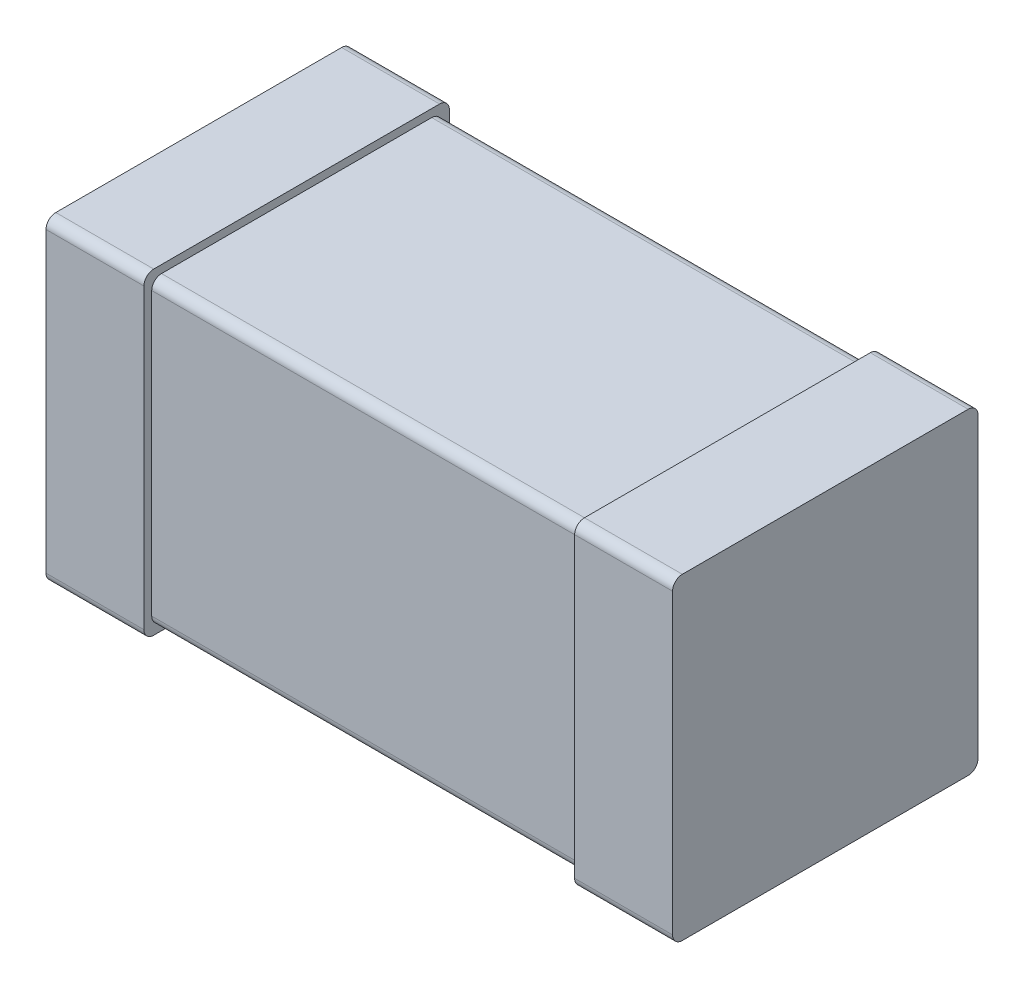
ISO-10303-21;
HEADER;
FILE_DESCRIPTION(('STEP AP214'),'2;1');
FILE_NAME('part.step','',(''),(''),'','','');
FILE_SCHEMA(('AUTOMOTIVE_DESIGN { 1 0 10303 214 1 1 1 1 }'));
ENDSEC;
DATA;
#1=APPLICATION_CONTEXT('core data for automotive mechanical design processes');
#2=APPLICATION_PROTOCOL_DEFINITION('international standard','automotive_design',2000,#1);
#3=PRODUCT_CONTEXT('',#1,'mechanical');
#4=PRODUCT('Part','Part','',(#3));
#5=PRODUCT_RELATED_PRODUCT_CATEGORY('part','',(#4));
#6=PRODUCT_DEFINITION_FORMATION('','',#4);
#7=PRODUCT_DEFINITION_CONTEXT('part definition',#1,'design');
#8=PRODUCT_DEFINITION('design','',#6,#7);
#9=PRODUCT_DEFINITION_SHAPE('','',#8);
#10=(LENGTH_UNIT() NAMED_UNIT(*) SI_UNIT(.MILLI.,.METRE.));
#11=(NAMED_UNIT(*) PLANE_ANGLE_UNIT() SI_UNIT($,.RADIAN.));
#12=(NAMED_UNIT(*) SI_UNIT($,.STERADIAN.) SOLID_ANGLE_UNIT());
#13=UNCERTAINTY_MEASURE_WITH_UNIT(LENGTH_MEASURE(1.E-05),#10,'distance_accuracy_value','');
#14=(GEOMETRIC_REPRESENTATION_CONTEXT(3) GLOBAL_UNCERTAINTY_ASSIGNED_CONTEXT((#13)) GLOBAL_UNIT_ASSIGNED_CONTEXT((#10,
#11,#12)) REPRESENTATION_CONTEXT('',''));
#15=CARTESIAN_POINT('',(0.,0.,0.));
#16=DIRECTION('',(0.,0.,1.));
#17=DIRECTION('',(1.,0.,0.));
#18=AXIS2_PLACEMENT_3D('',#15,#16,#17);
#19=CARTESIAN_POINT('',(-0.8,-0.405,0.));
#20=DIRECTION('',(1.,0.,0.));
#21=DIRECTION('',(0.,0.,-1.));
#22=AXIS2_PLACEMENT_3D('',#19,#20,#21);
#23=PLANE('',#22);
#24=DIRECTION('',(0.,1.,0.));
#25=VECTOR('',#24,1.);
#26=CARTESIAN_POINT('',(-0.8,-0.405,0.78));
#27=LINE('',#26,#25);
#28=CARTESIAN_POINT('',(-0.8,0.38,0.78));
#29=VERTEX_POINT('',#28);
#30=CARTESIAN_POINT('',(-0.8,-0.38,0.78));
#31=VERTEX_POINT('',#30);
#32=EDGE_CURVE('E300',#29,#31,#27,.F.);
#33=ORIENTED_EDGE('',*,*,#32,.F.);
#34=CARTESIAN_POINT('',(-0.8,0.38,0.755));
#35=DIRECTION('',(1.,0.,0.));
#36=DIRECTION('',(0.,0.,-1.));
#37=AXIS2_PLACEMENT_3D('',#34,#35,#36);
#38=CIRCLE('',#37,0.025);
#39=CARTESIAN_POINT('',(-0.8,0.405,0.755));
#40=VERTEX_POINT('',#39);
#41=EDGE_CURVE('E279',#40,#29,#38,.T.);
#42=ORIENTED_EDGE('',*,*,#41,.F.);
#43=DIRECTION('',(0.,0.,1.));
#44=VECTOR('',#43,1.);
#45=CARTESIAN_POINT('',(-0.8,0.405,0.));
#46=LINE('',#45,#44);
#47=CARTESIAN_POINT('',(-0.8,0.405,0.025));
#48=VERTEX_POINT('',#47);
#49=EDGE_CURVE('E201',#48,#40,#46,.T.);
#50=ORIENTED_EDGE('',*,*,#49,.F.);
#51=CARTESIAN_POINT('',(-0.8,0.38,0.025));
#52=DIRECTION('',(1.,0.,0.));
#53=DIRECTION('',(0.,0.,-1.));
#54=AXIS2_PLACEMENT_3D('',#51,#52,#53);
#55=CIRCLE('',#54,0.025);
#56=CARTESIAN_POINT('',(-0.8,0.38,0.));
#57=VERTEX_POINT('',#56);
#58=EDGE_CURVE('E196',#57,#48,#55,.T.);
#59=ORIENTED_EDGE('',*,*,#58,.F.);
#60=DIRECTION('',(0.,1.,0.));
#61=VECTOR('',#60,1.);
#62=CARTESIAN_POINT('',(-0.8,-0.405,0.));
#63=LINE('',#62,#61);
#64=CARTESIAN_POINT('',(-0.8,-0.38,0.));
#65=VERTEX_POINT('',#64);
#66=EDGE_CURVE('E188',#57,#65,#63,.F.);
#67=ORIENTED_EDGE('',*,*,#66,.T.);
#68=CARTESIAN_POINT('',(-0.8,-0.38,0.025));
#69=DIRECTION('',(1.,0.,0.));
#70=DIRECTION('',(0.,0.,-1.));
#71=AXIS2_PLACEMENT_3D('',#68,#69,#70);
#72=CIRCLE('',#71,0.025);
#73=CARTESIAN_POINT('',(-0.8,-0.405,0.025));
#74=VERTEX_POINT('',#73);
#75=EDGE_CURVE('E20',#74,#65,#72,.T.);
#76=ORIENTED_EDGE('',*,*,#75,.F.);
#77=DIRECTION('',(0.,0.,1.));
#78=VECTOR('',#77,1.);
#79=CARTESIAN_POINT('',(-0.8,-0.405,0.));
#80=LINE('',#79,#78);
#81=CARTESIAN_POINT('',(-0.8,-0.405,0.755));
#82=VERTEX_POINT('',#81);
#83=EDGE_CURVE('E171',#74,#82,#80,.T.);
#84=ORIENTED_EDGE('',*,*,#83,.T.);
#85=CARTESIAN_POINT('',(-0.8,-0.38,0.755));
#86=DIRECTION('',(1.,0.,0.));
#87=DIRECTION('',(0.,0.,-1.));
#88=AXIS2_PLACEMENT_3D('',#85,#86,#87);
#89=CIRCLE('',#88,0.025);
#90=EDGE_CURVE('E275',#31,#82,#89,.T.);
#91=ORIENTED_EDGE('',*,*,#90,.F.);
#92=EDGE_LOOP('',(#33,#42,#50,#59,#67,#76,#84,#91));
#93=FACE_BOUND('',#92,.T.);
#94=ADVANCED_FACE('F17',(#93),#23,.F.);
#95=CARTESIAN_POINT('',(0.8,-0.405,0.));
#96=DIRECTION('',(1.,0.,0.));
#97=DIRECTION('',(0.,0.,-1.));
#98=AXIS2_PLACEMENT_3D('',#95,#96,#97);
#99=PLANE('',#98);
#100=DIRECTION('',(0.,1.,0.));
#101=VECTOR('',#100,1.);
#102=CARTESIAN_POINT('',(0.8,-0.405,0.78));
#103=LINE('',#102,#101);
#104=CARTESIAN_POINT('',(0.8,-0.38,0.78));
#105=VERTEX_POINT('',#104);
#106=CARTESIAN_POINT('',(0.8,0.38,0.78));
#107=VERTEX_POINT('',#106);
#108=EDGE_CURVE('E290',#105,#107,#103,.T.);
#109=ORIENTED_EDGE('',*,*,#108,.F.);
#110=CARTESIAN_POINT('',(0.8,-0.38,0.755));
#111=DIRECTION('',(1.,0.,0.));
#112=DIRECTION('',(0.,0.,-1.));
#113=AXIS2_PLACEMENT_3D('',#110,#111,#112);
#114=CIRCLE('',#113,0.025);
#115=CARTESIAN_POINT('',(0.8,-0.405,0.755));
#116=VERTEX_POINT('',#115);
#117=EDGE_CURVE('E259',#116,#105,#114,.F.);
#118=ORIENTED_EDGE('',*,*,#117,.F.);
#119=DIRECTION('',(0.,0.,1.));
#120=VECTOR('',#119,1.);
#121=CARTESIAN_POINT('',(0.8,-0.405,0.));
#122=LINE('',#121,#120);
#123=CARTESIAN_POINT('',(0.8,-0.405,0.025));
#124=VERTEX_POINT('',#123);
#125=EDGE_CURVE('E274',#116,#124,#122,.F.);
#126=ORIENTED_EDGE('',*,*,#125,.T.);
#127=CARTESIAN_POINT('',(0.8,-0.38,0.025));
#128=DIRECTION('',(1.,0.,0.));
#129=DIRECTION('',(0.,0.,-1.));
#130=AXIS2_PLACEMENT_3D('',#127,#128,#129);
#131=CIRCLE('',#130,0.025);
#132=CARTESIAN_POINT('',(0.8,-0.38,0.));
#133=VERTEX_POINT('',#132);
#134=EDGE_CURVE('E271',#133,#124,#131,.F.);
#135=ORIENTED_EDGE('',*,*,#134,.F.);
#136=DIRECTION('',(0.,1.,0.));
#137=VECTOR('',#136,1.);
#138=CARTESIAN_POINT('',(0.8,-0.405,0.));
#139=LINE('',#138,#137);
#140=CARTESIAN_POINT('',(0.8,0.38,0.));
#141=VERTEX_POINT('',#140);
#142=EDGE_CURVE('E270',#133,#141,#139,.T.);
#143=ORIENTED_EDGE('',*,*,#142,.T.);
#144=CARTESIAN_POINT('',(0.8,0.38,0.025));
#145=DIRECTION('',(1.,0.,0.));
#146=DIRECTION('',(0.,0.,-1.));
#147=AXIS2_PLACEMENT_3D('',#144,#145,#146);
#148=CIRCLE('',#147,0.025);
#149=CARTESIAN_POINT('',(0.8,0.405,0.025));
#150=VERTEX_POINT('',#149);
#151=EDGE_CURVE('E267',#150,#141,#148,.F.);
#152=ORIENTED_EDGE('',*,*,#151,.F.);
#153=DIRECTION('',(0.,0.,1.));
#154=VECTOR('',#153,1.);
#155=CARTESIAN_POINT('',(0.8,0.405,0.));
#156=LINE('',#155,#154);
#157=CARTESIAN_POINT('',(0.8,0.405,0.755));
#158=VERTEX_POINT('',#157);
#159=EDGE_CURVE('E295',#158,#150,#156,.F.);
#160=ORIENTED_EDGE('',*,*,#159,.F.);
#161=CARTESIAN_POINT('',(0.8,0.38,0.755));
#162=DIRECTION('',(1.,0.,0.));
#163=DIRECTION('',(0.,0.,-1.));
#164=AXIS2_PLACEMENT_3D('',#161,#162,#163);
#165=CIRCLE('',#164,0.025);
#166=EDGE_CURVE('E263',#107,#158,#165,.F.);
#167=ORIENTED_EDGE('',*,*,#166,.F.);
#168=EDGE_LOOP('',(#109,#118,#126,#135,#143,#152,#160,#167));
#169=FACE_BOUND('',#168,.T.);
#170=ADVANCED_FACE('F444',(#169),#99,.T.);
#171=CARTESIAN_POINT('',(-0.8,-0.405,0.));
#172=DIRECTION('',(0.,1.,0.));
#173=DIRECTION('',(0.,0.,1.));
#174=AXIS2_PLACEMENT_3D('',#171,#172,#173);
#175=PLANE('',#174);
#176=ORIENTED_EDGE('',*,*,#83,.F.);
#177=DIRECTION('',(1.,0.,0.));
#178=VECTOR('',#177,1.);
#179=CARTESIAN_POINT('',(-0.8,-0.405,0.025));
#180=LINE('',#179,#178);
#181=CARTESIAN_POINT('',(-0.55,-0.405,0.025));
#182=VERTEX_POINT('',#181);
#183=EDGE_CURVE('E182',#182,#74,#180,.F.);
#184=ORIENTED_EDGE('',*,*,#183,.F.);
#185=DIRECTION('',(0.,0.,-1.));
#186=VECTOR('',#185,1.);
#187=CARTESIAN_POINT('',(-0.55,-0.405,0.));
#188=LINE('',#187,#186);
#189=CARTESIAN_POINT('',(-0.55,-0.405,0.755));
#190=VERTEX_POINT('',#189);
#191=EDGE_CURVE('E258',#190,#182,#188,.T.);
#192=ORIENTED_EDGE('',*,*,#191,.F.);
#193=DIRECTION('',(1.,0.,0.));
#194=VECTOR('',#193,1.);
#195=CARTESIAN_POINT('',(-0.8,-0.405,0.755));
#196=LINE('',#195,#194);
#197=EDGE_CURVE('E307',#82,#190,#196,.T.);
#198=ORIENTED_EDGE('',*,*,#197,.F.);
#199=EDGE_LOOP('',(#176,#184,#192,#198));
#200=FACE_BOUND('',#199,.T.);
#201=ADVANCED_FACE('F310',(#200),#175,.F.);
#202=CARTESIAN_POINT('',(-0.8,-0.38,0.025));
#203=DIRECTION('',(1.,0.,0.));
#204=DIRECTION('',(0.,0.,-1.));
#205=AXIS2_PLACEMENT_3D('',#202,#203,#204);
#206=CYLINDRICAL_SURFACE('',#205,0.025);
#207=CARTESIAN_POINT('',(-0.55,-0.38,0.025));
#208=DIRECTION('',(1.,0.,0.));
#209=DIRECTION('',(0.,0.,-1.));
#210=AXIS2_PLACEMENT_3D('',#207,#208,#209);
#211=CIRCLE('',#210,0.025);
#212=CARTESIAN_POINT('',(-0.55,-0.38,0.));
#213=VERTEX_POINT('',#212);
#214=EDGE_CURVE('E256',#182,#213,#211,.T.);
#215=ORIENTED_EDGE('',*,*,#214,.F.);
#216=ORIENTED_EDGE('',*,*,#183,.T.);
#217=ORIENTED_EDGE('',*,*,#75,.T.);
#218=DIRECTION('',(1.,0.,0.));
#219=VECTOR('',#218,1.);
#220=CARTESIAN_POINT('',(-0.8,-0.38,0.));
#221=LINE('',#220,#219);
#222=EDGE_CURVE('E180',#65,#213,#221,.T.);
#223=ORIENTED_EDGE('',*,*,#222,.T.);
#224=EDGE_LOOP('',(#215,#216,#217,#223));
#225=FACE_BOUND('',#224,.T.);
#226=ADVANCED_FACE('F179',(#225),#206,.T.);
#227=CARTESIAN_POINT('',(-0.8,-0.405,0.));
#228=DIRECTION('',(0.,0.,1.));
#229=DIRECTION('',(1.,0.,0.));
#230=AXIS2_PLACEMENT_3D('',#227,#228,#229);
#231=PLANE('',#230);
#232=DIRECTION('',(0.,1.,0.));
#233=VECTOR('',#232,1.);
#234=CARTESIAN_POINT('',(-0.55,-0.405,0.));
#235=LINE('',#234,#233);
#236=CARTESIAN_POINT('',(-0.55,0.38,0.));
#237=VERTEX_POINT('',#236);
#238=EDGE_CURVE('E190',#213,#237,#235,.T.);
#239=ORIENTED_EDGE('',*,*,#238,.F.);
#240=ORIENTED_EDGE('',*,*,#222,.F.);
#241=ORIENTED_EDGE('',*,*,#66,.F.);
#242=DIRECTION('',(1.,0.,0.));
#243=VECTOR('',#242,1.);
#244=CARTESIAN_POINT('',(-0.8,0.38,0.));
#245=LINE('',#244,#243);
#246=EDGE_CURVE('E191',#237,#57,#245,.F.);
#247=ORIENTED_EDGE('',*,*,#246,.F.);
#248=EDGE_LOOP('',(#239,#240,#241,#247));
#249=FACE_BOUND('',#248,.T.);
#250=ADVANCED_FACE('F186',(#249),#231,.F.);
#251=CARTESIAN_POINT('',(-0.8,0.38,0.025));
#252=DIRECTION('',(1.,0.,0.));
#253=DIRECTION('',(0.,0.,-1.));
#254=AXIS2_PLACEMENT_3D('',#251,#252,#253);
#255=CYLINDRICAL_SURFACE('',#254,0.025);
#256=ORIENTED_EDGE('',*,*,#246,.T.);
#257=ORIENTED_EDGE('',*,*,#58,.T.);
#258=DIRECTION('',(1.,0.,0.));
#259=VECTOR('',#258,1.);
#260=CARTESIAN_POINT('',(-0.8,0.405,0.025));
#261=LINE('',#260,#259);
#262=CARTESIAN_POINT('',(-0.55,0.405,0.025));
#263=VERTEX_POINT('',#262);
#264=EDGE_CURVE('E281',#263,#48,#261,.F.);
#265=ORIENTED_EDGE('',*,*,#264,.F.);
#266=CARTESIAN_POINT('',(-0.55,0.38,0.025));
#267=DIRECTION('',(1.,0.,0.));
#268=DIRECTION('',(0.,0.,-1.));
#269=AXIS2_PLACEMENT_3D('',#266,#267,#268);
#270=CIRCLE('',#269,0.025);
#271=EDGE_CURVE('E254',#237,#263,#270,.T.);
#272=ORIENTED_EDGE('',*,*,#271,.F.);
#273=EDGE_LOOP('',(#256,#257,#265,#272));
#274=FACE_BOUND('',#273,.T.);
#275=ADVANCED_FACE('F631',(#274),#255,.T.);
#276=CARTESIAN_POINT('',(-0.8,0.405,0.));
#277=DIRECTION('',(0.,1.,0.));
#278=DIRECTION('',(0.,0.,1.));
#279=AXIS2_PLACEMENT_3D('',#276,#277,#278);
#280=PLANE('',#279);
#281=ORIENTED_EDGE('',*,*,#49,.T.);
#282=DIRECTION('',(1.,0.,0.));
#283=VECTOR('',#282,1.);
#284=CARTESIAN_POINT('',(-0.8,0.405,0.755));
#285=LINE('',#284,#283);
#286=CARTESIAN_POINT('',(-0.55,0.405,0.755));
#287=VERTEX_POINT('',#286);
#288=EDGE_CURVE('E280',#287,#40,#285,.F.);
#289=ORIENTED_EDGE('',*,*,#288,.F.);
#290=DIRECTION('',(0.,0.,-1.));
#291=VECTOR('',#290,1.);
#292=CARTESIAN_POINT('',(-0.55,0.405,0.));
#293=LINE('',#292,#291);
#294=EDGE_CURVE('E253',#263,#287,#293,.F.);
#295=ORIENTED_EDGE('',*,*,#294,.F.);
#296=ORIENTED_EDGE('',*,*,#264,.T.);
#297=EDGE_LOOP('',(#281,#289,#295,#296));
#298=FACE_BOUND('',#297,.T.);
#299=ADVANCED_FACE('F623',(#298),#280,.T.);
#300=CARTESIAN_POINT('',(-0.8,0.38,0.755));
#301=DIRECTION('',(1.,0.,0.));
#302=DIRECTION('',(0.,0.,-1.));
#303=AXIS2_PLACEMENT_3D('',#300,#301,#302);
#304=CYLINDRICAL_SURFACE('',#303,0.025);
#305=CARTESIAN_POINT('',(-0.55,0.38,0.755));
#306=DIRECTION('',(1.,0.,0.));
#307=DIRECTION('',(0.,0.,-1.));
#308=AXIS2_PLACEMENT_3D('',#305,#306,#307);
#309=CIRCLE('',#308,0.025);
#310=CARTESIAN_POINT('',(-0.55,0.38,0.78));
#311=VERTEX_POINT('',#310);
#312=EDGE_CURVE('E251',#287,#311,#309,.T.);
#313=ORIENTED_EDGE('',*,*,#312,.F.);
#314=ORIENTED_EDGE('',*,*,#288,.T.);
#315=ORIENTED_EDGE('',*,*,#41,.T.);
#316=DIRECTION('',(1.,0.,0.));
#317=VECTOR('',#316,1.);
#318=CARTESIAN_POINT('',(-0.8,0.38,0.78));
#319=LINE('',#318,#317);
#320=EDGE_CURVE('E301',#311,#29,#319,.F.);
#321=ORIENTED_EDGE('',*,*,#320,.F.);
#322=EDGE_LOOP('',(#313,#314,#315,#321));
#323=FACE_BOUND('',#322,.T.);
#324=ADVANCED_FACE('F322',(#323),#304,.T.);
#325=CARTESIAN_POINT('',(-0.8,-0.405,0.78));
#326=DIRECTION('',(0.,0.,1.));
#327=DIRECTION('',(1.,0.,0.));
#328=AXIS2_PLACEMENT_3D('',#325,#326,#327);
#329=PLANE('',#328);
#330=DIRECTION('',(0.,1.,0.));
#331=VECTOR('',#330,1.);
#332=CARTESIAN_POINT('',(-0.55,-0.405,0.78));
#333=LINE('',#332,#331);
#334=CARTESIAN_POINT('',(-0.55,-0.38,0.78));
#335=VERTEX_POINT('',#334);
#336=EDGE_CURVE('E250',#311,#335,#333,.F.);
#337=ORIENTED_EDGE('',*,*,#336,.F.);
#338=ORIENTED_EDGE('',*,*,#320,.T.);
#339=ORIENTED_EDGE('',*,*,#32,.T.);
#340=DIRECTION('',(1.,0.,0.));
#341=VECTOR('',#340,1.);
#342=CARTESIAN_POINT('',(-0.8,-0.38,0.78));
#343=LINE('',#342,#341);
#344=EDGE_CURVE('E278',#335,#31,#343,.F.);
#345=ORIENTED_EDGE('',*,*,#344,.F.);
#346=EDGE_LOOP('',(#337,#338,#339,#345));
#347=FACE_BOUND('',#346,.T.);
#348=ADVANCED_FACE('F328',(#347),#329,.T.);
#349=CARTESIAN_POINT('',(-0.8,-0.38,0.755));
#350=DIRECTION('',(1.,0.,0.));
#351=DIRECTION('',(0.,0.,-1.));
#352=AXIS2_PLACEMENT_3D('',#349,#350,#351);
#353=CYLINDRICAL_SURFACE('',#352,0.025);
#354=ORIENTED_EDGE('',*,*,#344,.T.);
#355=ORIENTED_EDGE('',*,*,#90,.T.);
#356=ORIENTED_EDGE('',*,*,#197,.T.);
#357=CARTESIAN_POINT('',(-0.55,-0.38,0.755));
#358=DIRECTION('',(1.,0.,0.));
#359=DIRECTION('',(0.,0.,-1.));
#360=AXIS2_PLACEMENT_3D('',#357,#358,#359);
#361=CIRCLE('',#360,0.025);
#362=EDGE_CURVE('E247',#335,#190,#361,.T.);
#363=ORIENTED_EDGE('',*,*,#362,.F.);
#364=EDGE_LOOP('',(#354,#355,#356,#363));
#365=FACE_BOUND('',#364,.T.);
#366=ADVANCED_FACE('F305',(#365),#353,.T.);
#367=CARTESIAN_POINT('',(0.55,-0.405,0.));
#368=DIRECTION('',(0.,1.,0.));
#369=DIRECTION('',(0.,0.,1.));
#370=AXIS2_PLACEMENT_3D('',#367,#368,#369);
#371=PLANE('',#370);
#372=DIRECTION('',(0.,0.,-1.));
#373=VECTOR('',#372,1.);
#374=CARTESIAN_POINT('',(0.55,-0.405,0.));
#375=LINE('',#374,#373);
#376=CARTESIAN_POINT('',(0.55,-0.405,0.755));
#377=VERTEX_POINT('',#376);
#378=CARTESIAN_POINT('',(0.55,-0.405,0.025));
#379=VERTEX_POINT('',#378);
#380=EDGE_CURVE('E236',#377,#379,#375,.T.);
#381=ORIENTED_EDGE('',*,*,#380,.T.);
#382=DIRECTION('',(1.,0.,0.));
#383=VECTOR('',#382,1.);
#384=CARTESIAN_POINT('',(0.55,-0.405,0.025));
#385=LINE('',#384,#383);
#386=EDGE_CURVE('E273',#124,#379,#385,.F.);
#387=ORIENTED_EDGE('',*,*,#386,.F.);
#388=ORIENTED_EDGE('',*,*,#125,.F.);
#389=DIRECTION('',(1.,0.,0.));
#390=VECTOR('',#389,1.);
#391=CARTESIAN_POINT('',(0.55,-0.405,0.755));
#392=LINE('',#391,#390);
#393=EDGE_CURVE('E262',#377,#116,#392,.T.);
#394=ORIENTED_EDGE('',*,*,#393,.F.);
#395=EDGE_LOOP('',(#381,#387,#388,#394));
#396=FACE_BOUND('',#395,.T.);
#397=ADVANCED_FACE('F369',(#396),#371,.F.);
#398=CARTESIAN_POINT('',(0.55,-0.38,0.025));
#399=DIRECTION('',(1.,0.,0.));
#400=DIRECTION('',(0.,0.,-1.));
#401=AXIS2_PLACEMENT_3D('',#398,#399,#400);
#402=CYLINDRICAL_SURFACE('',#401,0.025);
#403=ORIENTED_EDGE('',*,*,#134,.T.);
#404=ORIENTED_EDGE('',*,*,#386,.T.);
#405=CARTESIAN_POINT('',(0.55,-0.38,0.025));
#406=DIRECTION('',(1.,0.,0.));
#407=DIRECTION('',(0.,0.,-1.));
#408=AXIS2_PLACEMENT_3D('',#405,#406,#407);
#409=CIRCLE('',#408,0.025);
#410=CARTESIAN_POINT('',(0.55,-0.38,0.));
#411=VERTEX_POINT('',#410);
#412=EDGE_CURVE('E233',#379,#411,#409,.T.);
#413=ORIENTED_EDGE('',*,*,#412,.T.);
#414=DIRECTION('',(1.,0.,0.));
#415=VECTOR('',#414,1.);
#416=CARTESIAN_POINT('',(0.55,-0.38,0.));
#417=LINE('',#416,#415);
#418=EDGE_CURVE('E299',#411,#133,#417,.T.);
#419=ORIENTED_EDGE('',*,*,#418,.T.);
#420=EDGE_LOOP('',(#403,#404,#413,#419));
#421=FACE_BOUND('',#420,.T.);
#422=ADVANCED_FACE('F358',(#421),#402,.T.);
#423=CARTESIAN_POINT('',(0.55,-0.405,0.));
#424=DIRECTION('',(0.,0.,1.));
#425=DIRECTION('',(1.,0.,0.));
#426=AXIS2_PLACEMENT_3D('',#423,#424,#425);
#427=PLANE('',#426);
#428=ORIENTED_EDGE('',*,*,#142,.F.);
#429=ORIENTED_EDGE('',*,*,#418,.F.);
#430=DIRECTION('',(0.,1.,0.));
#431=VECTOR('',#430,1.);
#432=CARTESIAN_POINT('',(0.55,-0.405,0.));
#433=LINE('',#432,#431);
#434=CARTESIAN_POINT('',(0.55,0.38,0.));
#435=VERTEX_POINT('',#434);
#436=EDGE_CURVE('E232',#411,#435,#433,.T.);
#437=ORIENTED_EDGE('',*,*,#436,.T.);
#438=DIRECTION('',(1.,0.,0.));
#439=VECTOR('',#438,1.);
#440=CARTESIAN_POINT('',(0.55,0.38,0.));
#441=LINE('',#440,#439);
#442=EDGE_CURVE('E269',#141,#435,#441,.F.);
#443=ORIENTED_EDGE('',*,*,#442,.F.);
#444=EDGE_LOOP('',(#428,#429,#437,#443));
#445=FACE_BOUND('',#444,.T.);
#446=ADVANCED_FACE('F441',(#445),#427,.F.);
#447=CARTESIAN_POINT('',(0.55,0.38,0.025));
#448=DIRECTION('',(1.,0.,0.));
#449=DIRECTION('',(0.,0.,-1.));
#450=AXIS2_PLACEMENT_3D('',#447,#448,#449);
#451=CYLINDRICAL_SURFACE('',#450,0.025);
#452=ORIENTED_EDGE('',*,*,#442,.T.);
#453=CARTESIAN_POINT('',(0.55,0.38,0.025));
#454=DIRECTION('',(1.,0.,0.));
#455=DIRECTION('',(0.,0.,-1.));
#456=AXIS2_PLACEMENT_3D('',#453,#454,#455);
#457=CIRCLE('',#456,0.025);
#458=CARTESIAN_POINT('',(0.55,0.405,0.025));
#459=VERTEX_POINT('',#458);
#460=EDGE_CURVE('E229',#435,#459,#457,.T.);
#461=ORIENTED_EDGE('',*,*,#460,.T.);
#462=DIRECTION('',(1.,0.,0.));
#463=VECTOR('',#462,1.);
#464=CARTESIAN_POINT('',(0.55,0.405,0.025));
#465=LINE('',#464,#463);
#466=EDGE_CURVE('E266',#150,#459,#465,.F.);
#467=ORIENTED_EDGE('',*,*,#466,.F.);
#468=ORIENTED_EDGE('',*,*,#151,.T.);
#469=EDGE_LOOP('',(#452,#461,#467,#468));
#470=FACE_BOUND('',#469,.T.);
#471=ADVANCED_FACE('F436',(#470),#451,.T.);
#472=CARTESIAN_POINT('',(0.55,0.405,0.));
#473=DIRECTION('',(0.,1.,0.));
#474=DIRECTION('',(0.,0.,1.));
#475=AXIS2_PLACEMENT_3D('',#472,#473,#474);
#476=PLANE('',#475);
#477=DIRECTION('',(0.,0.,-1.));
#478=VECTOR('',#477,1.);
#479=CARTESIAN_POINT('',(0.55,0.405,0.));
#480=LINE('',#479,#478);
#481=CARTESIAN_POINT('',(0.55,0.405,0.755));
#482=VERTEX_POINT('',#481);
#483=EDGE_CURVE('E228',#459,#482,#480,.F.);
#484=ORIENTED_EDGE('',*,*,#483,.T.);
#485=DIRECTION('',(1.,0.,0.));
#486=VECTOR('',#485,1.);
#487=CARTESIAN_POINT('',(0.55,0.405,0.755));
#488=LINE('',#487,#486);
#489=EDGE_CURVE('E265',#158,#482,#488,.F.);
#490=ORIENTED_EDGE('',*,*,#489,.F.);
#491=ORIENTED_EDGE('',*,*,#159,.T.);
#492=ORIENTED_EDGE('',*,*,#466,.T.);
#493=EDGE_LOOP('',(#484,#490,#491,#492));
#494=FACE_BOUND('',#493,.T.);
#495=ADVANCED_FACE('F432',(#494),#476,.T.);
#496=CARTESIAN_POINT('',(0.55,0.38,0.755));
#497=DIRECTION('',(1.,0.,0.));
#498=DIRECTION('',(0.,0.,-1.));
#499=AXIS2_PLACEMENT_3D('',#496,#497,#498);
#500=CYLINDRICAL_SURFACE('',#499,0.025);
#501=ORIENTED_EDGE('',*,*,#166,.T.);
#502=ORIENTED_EDGE('',*,*,#489,.T.);
#503=CARTESIAN_POINT('',(0.55,0.38,0.755));
#504=DIRECTION('',(1.,0.,0.));
#505=DIRECTION('',(0.,0.,-1.));
#506=AXIS2_PLACEMENT_3D('',#503,#504,#505);
#507=CIRCLE('',#506,0.025);
#508=CARTESIAN_POINT('',(0.55,0.38,0.78));
#509=VERTEX_POINT('',#508);
#510=EDGE_CURVE('E225',#482,#509,#507,.T.);
#511=ORIENTED_EDGE('',*,*,#510,.T.);
#512=DIRECTION('',(1.,0.,0.));
#513=VECTOR('',#512,1.);
#514=CARTESIAN_POINT('',(0.55,0.38,0.78));
#515=LINE('',#514,#513);
#516=EDGE_CURVE('E292',#107,#509,#515,.F.);
#517=ORIENTED_EDGE('',*,*,#516,.F.);
#518=EDGE_LOOP('',(#501,#502,#511,#517));
#519=FACE_BOUND('',#518,.T.);
#520=ADVANCED_FACE('F455',(#519),#500,.T.);
#521=CARTESIAN_POINT('',(0.55,-0.405,0.78));
#522=DIRECTION('',(0.,0.,1.));
#523=DIRECTION('',(1.,0.,0.));
#524=AXIS2_PLACEMENT_3D('',#521,#522,#523);
#525=PLANE('',#524);
#526=ORIENTED_EDGE('',*,*,#108,.T.);
#527=ORIENTED_EDGE('',*,*,#516,.T.);
#528=DIRECTION('',(0.,1.,0.));
#529=VECTOR('',#528,1.);
#530=CARTESIAN_POINT('',(0.55,-0.405,0.78));
#531=LINE('',#530,#529);
#532=CARTESIAN_POINT('',(0.55,-0.38,0.78));
#533=VERTEX_POINT('',#532);
#534=EDGE_CURVE('E224',#509,#533,#531,.F.);
#535=ORIENTED_EDGE('',*,*,#534,.T.);
#536=DIRECTION('',(1.,0.,0.));
#537=VECTOR('',#536,1.);
#538=CARTESIAN_POINT('',(0.55,-0.38,0.78));
#539=LINE('',#538,#537);
#540=EDGE_CURVE('E261',#105,#533,#539,.F.);
#541=ORIENTED_EDGE('',*,*,#540,.F.);
#542=EDGE_LOOP('',(#526,#527,#535,#541));
#543=FACE_BOUND('',#542,.T.);
#544=ADVANCED_FACE('F451',(#543),#525,.T.);
#545=CARTESIAN_POINT('',(0.55,-0.38,0.755));
#546=DIRECTION('',(1.,0.,0.));
#547=DIRECTION('',(0.,0.,-1.));
#548=AXIS2_PLACEMENT_3D('',#545,#546,#547);
#549=CYLINDRICAL_SURFACE('',#548,0.025);
#550=ORIENTED_EDGE('',*,*,#540,.T.);
#551=CARTESIAN_POINT('',(0.55,-0.38,0.755));
#552=DIRECTION('',(1.,0.,0.));
#553=DIRECTION('',(0.,0.,-1.));
#554=AXIS2_PLACEMENT_3D('',#551,#552,#553);
#555=CIRCLE('',#554,0.025);
#556=EDGE_CURVE('E221',#533,#377,#555,.T.);
#557=ORIENTED_EDGE('',*,*,#556,.T.);
#558=ORIENTED_EDGE('',*,*,#393,.T.);
#559=ORIENTED_EDGE('',*,*,#117,.T.);
#560=EDGE_LOOP('',(#550,#557,#558,#559));
#561=FACE_BOUND('',#560,.T.);
#562=ADVANCED_FACE('F448',(#561),#549,.T.);
#563=CARTESIAN_POINT('',(-0.55,-0.385,0.02));
#564=DIRECTION('',(0.,1.,0.));
#565=DIRECTION('',(0.,0.,1.));
#566=AXIS2_PLACEMENT_3D('',#563,#564,#565);
#567=PLANE('',#566);
#568=DIRECTION('',(0.,0.,-1.));
#569=VECTOR('',#568,1.);
#570=CARTESIAN_POINT('',(-0.55,-0.385,0.));
#571=LINE('',#570,#569);
#572=CARTESIAN_POINT('',(-0.55,-0.385,0.045));
#573=VERTEX_POINT('',#572);
#574=CARTESIAN_POINT('',(-0.55,-0.385,0.735));
#575=VERTEX_POINT('',#574);
#576=EDGE_CURVE('E246',#573,#575,#571,.F.);
#577=ORIENTED_EDGE('',*,*,#576,.F.);
#578=DIRECTION('',(1.,0.,0.));
#579=VECTOR('',#578,1.);
#580=CARTESIAN_POINT('',(-0.55,-0.385,0.045));
#581=LINE('',#580,#579);
#582=CARTESIAN_POINT('',(0.55,-0.385,0.045));
#583=VERTEX_POINT('',#582);
#584=EDGE_CURVE('E239',#583,#573,#581,.F.);
#585=ORIENTED_EDGE('',*,*,#584,.F.);
#586=DIRECTION('',(0.,0.,-1.));
#587=VECTOR('',#586,1.);
#588=CARTESIAN_POINT('',(0.55,-0.385,0.));
#589=LINE('',#588,#587);
#590=CARTESIAN_POINT('',(0.55,-0.385,0.735));
#591=VERTEX_POINT('',#590);
#592=EDGE_CURVE('E217',#583,#591,#589,.F.);
#593=ORIENTED_EDGE('',*,*,#592,.T.);
#594=DIRECTION('',(1.,0.,0.));
#595=VECTOR('',#594,1.);
#596=CARTESIAN_POINT('',(-0.55,-0.385,0.735));
#597=LINE('',#596,#595);
#598=EDGE_CURVE('E344',#575,#591,#597,.T.);
#599=ORIENTED_EDGE('',*,*,#598,.F.);
#600=EDGE_LOOP('',(#577,#585,#593,#599));
#601=FACE_BOUND('',#600,.T.);
#602=ADVANCED_FACE('F420',(#601),#567,.F.);
#603=CARTESIAN_POINT('',(-0.55,-0.36,0.735));
#604=DIRECTION('',(1.,0.,0.));
#605=DIRECTION('',(0.,0.,-1.));
#606=AXIS2_PLACEMENT_3D('',#603,#604,#605);
#607=CYLINDRICAL_SURFACE('',#606,0.025);
#608=DIRECTION('',(1.,0.,0.));
#609=VECTOR('',#608,1.);
#610=CARTESIAN_POINT('',(-0.55,-0.36,0.76));
#611=LINE('',#610,#609);
#612=CARTESIAN_POINT('',(-0.55,-0.36,0.76));
#613=VERTEX_POINT('',#612);
#614=CARTESIAN_POINT('',(0.55,-0.36,0.76));
#615=VERTEX_POINT('',#614);
#616=EDGE_CURVE('E342',#613,#615,#611,.T.);
#617=ORIENTED_EDGE('',*,*,#616,.F.);
#618=CARTESIAN_POINT('',(-0.55,-0.36,0.735));
#619=DIRECTION('',(1.,0.,0.));
#620=DIRECTION('',(0.,0.,-1.));
#621=AXIS2_PLACEMENT_3D('',#618,#619,#620);
#622=CIRCLE('',#621,0.025);
#623=EDGE_CURVE('E244',#575,#613,#622,.F.);
#624=ORIENTED_EDGE('',*,*,#623,.F.);
#625=ORIENTED_EDGE('',*,*,#598,.T.);
#626=CARTESIAN_POINT('',(0.55,-0.36,0.735));
#627=DIRECTION('',(1.,0.,0.));
#628=DIRECTION('',(0.,0.,-1.));
#629=AXIS2_PLACEMENT_3D('',#626,#627,#628);
#630=CIRCLE('',#629,0.025);
#631=EDGE_CURVE('E214',#591,#615,#630,.F.);
#632=ORIENTED_EDGE('',*,*,#631,.T.);
#633=EDGE_LOOP('',(#617,#624,#625,#632));
#634=FACE_BOUND('',#633,.T.);
#635=ADVANCED_FACE('F422',(#634),#607,.T.);
#636=CARTESIAN_POINT('',(-0.55,-0.385,0.76));
#637=DIRECTION('',(0.,0.,1.));
#638=DIRECTION('',(1.,0.,0.));
#639=AXIS2_PLACEMENT_3D('',#636,#637,#638);
#640=PLANE('',#639);
#641=DIRECTION('',(0.,1.,0.));
#642=VECTOR('',#641,1.);
#643=CARTESIAN_POINT('',(0.55,-0.405,0.76));
#644=LINE('',#643,#642);
#645=CARTESIAN_POINT('',(0.55,0.36,0.76));
#646=VERTEX_POINT('',#645);
#647=EDGE_CURVE('E213',#615,#646,#644,.T.);
#648=ORIENTED_EDGE('',*,*,#647,.T.);
#649=DIRECTION('',(1.,0.,0.));
#650=VECTOR('',#649,1.);
#651=CARTESIAN_POINT('',(-0.55,0.36,0.76));
#652=LINE('',#651,#650);
#653=CARTESIAN_POINT('',(-0.55,0.36,0.76));
#654=VERTEX_POINT('',#653);
#655=EDGE_CURVE('E340',#654,#646,#652,.T.);
#656=ORIENTED_EDGE('',*,*,#655,.F.);
#657=DIRECTION('',(0.,1.,0.));
#658=VECTOR('',#657,1.);
#659=CARTESIAN_POINT('',(-0.55,-0.405,0.76));
#660=LINE('',#659,#658);
#661=EDGE_CURVE('E243',#613,#654,#660,.T.);
#662=ORIENTED_EDGE('',*,*,#661,.F.);
#663=ORIENTED_EDGE('',*,*,#616,.T.);
#664=EDGE_LOOP('',(#648,#656,#662,#663));
#665=FACE_BOUND('',#664,.T.);
#666=ADVANCED_FACE('F393',(#665),#640,.T.);
#667=CARTESIAN_POINT('',(-0.55,0.36,0.735));
#668=DIRECTION('',(1.,0.,0.));
#669=DIRECTION('',(0.,0.,-1.));
#670=AXIS2_PLACEMENT_3D('',#667,#668,#669);
#671=CYLINDRICAL_SURFACE('',#670,0.025);
#672=CARTESIAN_POINT('',(0.55,0.36,0.735));
#673=DIRECTION('',(1.,0.,0.));
#674=DIRECTION('',(0.,0.,-1.));
#675=AXIS2_PLACEMENT_3D('',#672,#673,#674);
#676=CIRCLE('',#675,0.025);
#677=CARTESIAN_POINT('',(0.55,0.385,0.735));
#678=VERTEX_POINT('',#677);
#679=EDGE_CURVE('E209',#646,#678,#676,.F.);
#680=ORIENTED_EDGE('',*,*,#679,.T.);
#681=DIRECTION('',(1.,0.,0.));
#682=VECTOR('',#681,1.);
#683=CARTESIAN_POINT('',(-0.55,0.385,0.735));
#684=LINE('',#683,#682);
#685=CARTESIAN_POINT('',(-0.55,0.385,0.735));
#686=VERTEX_POINT('',#685);
#687=EDGE_CURVE('E337',#686,#678,#684,.T.);
#688=ORIENTED_EDGE('',*,*,#687,.F.);
#689=CARTESIAN_POINT('',(-0.55,0.36,0.735));
#690=DIRECTION('',(1.,0.,0.));
#691=DIRECTION('',(0.,0.,-1.));
#692=AXIS2_PLACEMENT_3D('',#689,#690,#691);
#693=CIRCLE('',#692,0.025);
#694=EDGE_CURVE('E241',#654,#686,#693,.F.);
#695=ORIENTED_EDGE('',*,*,#694,.F.);
#696=ORIENTED_EDGE('',*,*,#655,.T.);
#697=EDGE_LOOP('',(#680,#688,#695,#696));
#698=FACE_BOUND('',#697,.T.);
#699=ADVANCED_FACE('F397',(#698),#671,.T.);
#700=CARTESIAN_POINT('',(-0.55,0.385,0.02));
#701=DIRECTION('',(0.,1.,0.));
#702=DIRECTION('',(0.,0.,1.));
#703=AXIS2_PLACEMENT_3D('',#700,#701,#702);
#704=PLANE('',#703);
#705=DIRECTION('',(0.,0.,-1.));
#706=VECTOR('',#705,1.);
#707=CARTESIAN_POINT('',(-0.55,0.385,0.));
#708=LINE('',#707,#706);
#709=CARTESIAN_POINT('',(-0.55,0.385,0.045));
#710=VERTEX_POINT('',#709);
#711=EDGE_CURVE('E240',#686,#710,#708,.T.);
#712=ORIENTED_EDGE('',*,*,#711,.F.);
#713=ORIENTED_EDGE('',*,*,#687,.T.);
#714=DIRECTION('',(0.,0.,-1.));
#715=VECTOR('',#714,1.);
#716=CARTESIAN_POINT('',(0.55,0.385,0.));
#717=LINE('',#716,#715);
#718=CARTESIAN_POINT('',(0.55,0.385,0.045));
#719=VERTEX_POINT('',#718);
#720=EDGE_CURVE('E212',#678,#719,#717,.T.);
#721=ORIENTED_EDGE('',*,*,#720,.T.);
#722=DIRECTION('',(1.,0.,0.));
#723=VECTOR('',#722,1.);
#724=CARTESIAN_POINT('',(-0.55,0.385,0.045));
#725=LINE('',#724,#723);
#726=EDGE_CURVE('E208',#710,#719,#725,.T.);
#727=ORIENTED_EDGE('',*,*,#726,.F.);
#728=EDGE_LOOP('',(#712,#713,#721,#727));
#729=FACE_BOUND('',#728,.T.);
#730=ADVANCED_FACE('F403',(#729),#704,.T.);
#731=CARTESIAN_POINT('',(-0.55,-0.405,0.));
#732=DIRECTION('',(1.,0.,0.));
#733=DIRECTION('',(0.,0.,-1.));
#734=AXIS2_PLACEMENT_3D('',#731,#732,#733);
#735=PLANE('',#734);
#736=CARTESIAN_POINT('',(-0.55,0.36,0.045));
#737=DIRECTION('',(1.,0.,0.));
#738=DIRECTION('',(0.,0.,-1.));
#739=AXIS2_PLACEMENT_3D('',#736,#737,#738);
#740=CIRCLE('',#739,0.025);
#741=CARTESIAN_POINT('',(-0.55,0.36,0.02));
#742=VERTEX_POINT('',#741);
#743=EDGE_CURVE('E203',#742,#710,#740,.T.);
#744=ORIENTED_EDGE('',*,*,#743,.F.);
#745=DIRECTION('',(0.,1.,0.));
#746=VECTOR('',#745,1.);
#747=CARTESIAN_POINT('',(-0.55,-0.385,0.02));
#748=LINE('',#747,#746);
#749=CARTESIAN_POINT('',(-0.55,-0.36,0.02));
#750=VERTEX_POINT('',#749);
#751=EDGE_CURVE('E206',#742,#750,#748,.F.);
#752=ORIENTED_EDGE('',*,*,#751,.T.);
#753=CARTESIAN_POINT('',(-0.55,-0.36,0.045));
#754=DIRECTION('',(1.,0.,0.));
#755=DIRECTION('',(0.,0.,-1.));
#756=AXIS2_PLACEMENT_3D('',#753,#754,#755);
#757=CIRCLE('',#756,0.025);
#758=EDGE_CURVE('E237',#573,#750,#757,.T.);
#759=ORIENTED_EDGE('',*,*,#758,.F.);
#760=ORIENTED_EDGE('',*,*,#576,.T.);
#761=ORIENTED_EDGE('',*,*,#623,.T.);
#762=ORIENTED_EDGE('',*,*,#661,.T.);
#763=ORIENTED_EDGE('',*,*,#694,.T.);
#764=ORIENTED_EDGE('',*,*,#711,.T.);
#765=EDGE_LOOP('',(#744,#752,#759,#760,#761,#762,#763,#764));
#766=FACE_BOUND('',#765,.T.);
#767=ORIENTED_EDGE('',*,*,#336,.T.);
#768=ORIENTED_EDGE('',*,*,#362,.T.);
#769=ORIENTED_EDGE('',*,*,#191,.T.);
#770=ORIENTED_EDGE('',*,*,#214,.T.);
#771=ORIENTED_EDGE('',*,*,#238,.T.);
#772=ORIENTED_EDGE('',*,*,#271,.T.);
#773=ORIENTED_EDGE('',*,*,#294,.T.);
#774=ORIENTED_EDGE('',*,*,#312,.T.);
#775=EDGE_LOOP('',(#767,#768,#769,#770,#771,#772,#773,#774));
#776=FACE_BOUND('',#775,.T.);
#777=ADVANCED_FACE('F386',(#766,#776),#735,.T.);
#778=CARTESIAN_POINT('',(-0.55,-0.36,0.045));
#779=DIRECTION('',(1.,0.,0.));
#780=DIRECTION('',(0.,0.,-1.));
#781=AXIS2_PLACEMENT_3D('',#778,#779,#780);
#782=CYLINDRICAL_SURFACE('',#781,0.025);
#783=CARTESIAN_POINT('',(0.55,-0.36,0.045));
#784=DIRECTION('',(1.,0.,0.));
#785=DIRECTION('',(0.,0.,-1.));
#786=AXIS2_PLACEMENT_3D('',#783,#784,#785);
#787=CIRCLE('',#786,0.025);
#788=CARTESIAN_POINT('',(0.55,-0.36,0.02));
#789=VERTEX_POINT('',#788);
#790=EDGE_CURVE('E218',#789,#583,#787,.F.);
#791=ORIENTED_EDGE('',*,*,#790,.T.);
#792=ORIENTED_EDGE('',*,*,#584,.T.);
#793=ORIENTED_EDGE('',*,*,#758,.T.);
#794=DIRECTION('',(1.,0.,0.));
#795=VECTOR('',#794,1.);
#796=CARTESIAN_POINT('',(-0.55,-0.36,0.02));
#797=LINE('',#796,#795);
#798=EDGE_CURVE('E374',#750,#789,#797,.T.);
#799=ORIENTED_EDGE('',*,*,#798,.T.);
#800=EDGE_LOOP('',(#791,#792,#793,#799));
#801=FACE_BOUND('',#800,.T.);
#802=ADVANCED_FACE('F416',(#801),#782,.T.);
#803=CARTESIAN_POINT('',(0.55,-0.405,0.));
#804=DIRECTION('',(1.,0.,0.));
#805=DIRECTION('',(0.,0.,-1.));
#806=AXIS2_PLACEMENT_3D('',#803,#804,#805);
#807=PLANE('',#806);
#808=CARTESIAN_POINT('',(0.55,0.36,0.045));
#809=DIRECTION('',(1.,0.,0.));
#810=DIRECTION('',(0.,0.,-1.));
#811=AXIS2_PLACEMENT_3D('',#808,#809,#810);
#812=CIRCLE('',#811,0.025);
#813=CARTESIAN_POINT('',(0.55,0.36,0.02));
#814=VERTEX_POINT('',#813);
#815=EDGE_CURVE('E34',#719,#814,#812,.F.);
#816=ORIENTED_EDGE('',*,*,#815,.F.);
#817=ORIENTED_EDGE('',*,*,#720,.F.);
#818=ORIENTED_EDGE('',*,*,#679,.F.);
#819=ORIENTED_EDGE('',*,*,#647,.F.);
#820=ORIENTED_EDGE('',*,*,#631,.F.);
#821=ORIENTED_EDGE('',*,*,#592,.F.);
#822=ORIENTED_EDGE('',*,*,#790,.F.);
#823=DIRECTION('',(0.,1.,0.));
#824=VECTOR('',#823,1.);
#825=CARTESIAN_POINT('',(0.55,-0.385,0.02));
#826=LINE('',#825,#824);
#827=EDGE_CURVE('E26',#789,#814,#826,.T.);
#828=ORIENTED_EDGE('',*,*,#827,.T.);
#829=EDGE_LOOP('',(#816,#817,#818,#819,#820,#821,#822,#828));
#830=FACE_BOUND('',#829,.T.);
#831=ORIENTED_EDGE('',*,*,#534,.F.);
#832=ORIENTED_EDGE('',*,*,#510,.F.);
#833=ORIENTED_EDGE('',*,*,#483,.F.);
#834=ORIENTED_EDGE('',*,*,#460,.F.);
#835=ORIENTED_EDGE('',*,*,#436,.F.);
#836=ORIENTED_EDGE('',*,*,#412,.F.);
#837=ORIENTED_EDGE('',*,*,#380,.F.);
#838=ORIENTED_EDGE('',*,*,#556,.F.);
#839=EDGE_LOOP('',(#831,#832,#833,#834,#835,#836,#837,#838));
#840=FACE_BOUND('',#839,.T.);
#841=ADVANCED_FACE('F364',(#830,#840),#807,.F.);
#842=CARTESIAN_POINT('',(-0.55,0.36,0.045));
#843=DIRECTION('',(1.,0.,0.));
#844=DIRECTION('',(0.,0.,-1.));
#845=AXIS2_PLACEMENT_3D('',#842,#843,#844);
#846=CYLINDRICAL_SURFACE('',#845,0.025);
#847=DIRECTION('',(1.,0.,0.));
#848=VECTOR('',#847,1.);
#849=CARTESIAN_POINT('',(-0.55,0.36,0.02));
#850=LINE('',#849,#848);
#851=EDGE_CURVE('E11',#814,#742,#850,.F.);
#852=ORIENTED_EDGE('',*,*,#851,.T.);
#853=ORIENTED_EDGE('',*,*,#743,.T.);
#854=ORIENTED_EDGE('',*,*,#726,.T.);
#855=ORIENTED_EDGE('',*,*,#815,.T.);
#856=EDGE_LOOP('',(#852,#853,#854,#855));
#857=FACE_BOUND('',#856,.T.);
#858=ADVANCED_FACE('F404',(#857),#846,.T.);
#859=CARTESIAN_POINT('',(-0.55,-0.385,0.02));
#860=DIRECTION('',(0.,0.,1.));
#861=DIRECTION('',(1.,0.,0.));
#862=AXIS2_PLACEMENT_3D('',#859,#860,#861);
#863=PLANE('',#862);
#864=ORIENTED_EDGE('',*,*,#827,.F.);
#865=ORIENTED_EDGE('',*,*,#798,.F.);
#866=ORIENTED_EDGE('',*,*,#751,.F.);
#867=ORIENTED_EDGE('',*,*,#851,.F.);
#868=EDGE_LOOP('',(#864,#865,#866,#867));
#869=FACE_BOUND('',#868,.T.);
#870=ADVANCED_FACE('F409',(#869),#863,.F.);
#871=CLOSED_SHELL('',(#94,#170,#201,#226,#250,#275,#299,#324,#348,#366,#397,#422,#446,#471,#495,
#520,#544,#562,#602,#635,#666,#699,#730,#777,#802,#841,#858,#870));
#872=MANIFOLD_SOLID_BREP('B1',#871);
#873=ADVANCED_BREP_SHAPE_REPRESENTATION('',(#18,#872),#14);
#874=SHAPE_DEFINITION_REPRESENTATION(#9,#873);
ENDSEC;
END-ISO-10303-21;
